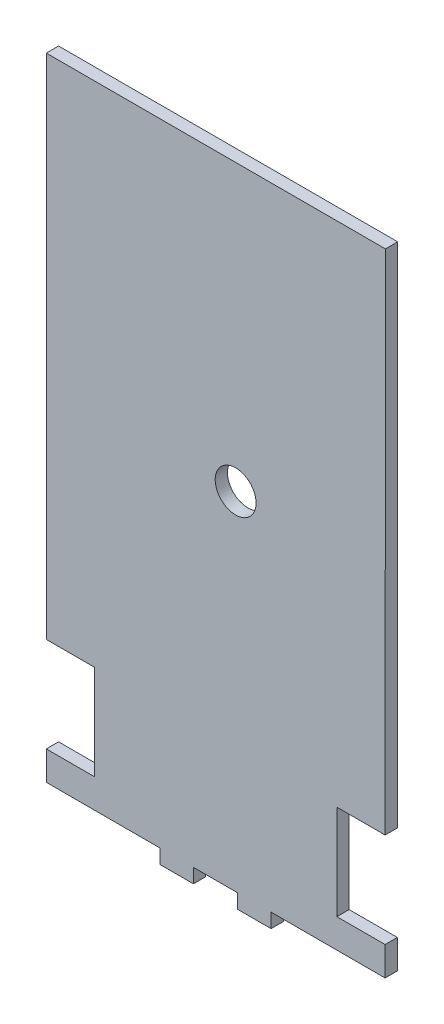
ISO-10303-21;
HEADER;
FILE_DESCRIPTION(('STEP AP214'),'2;1');
FILE_NAME('part.step','',(''),(''),'','','');
FILE_SCHEMA(('AUTOMOTIVE_DESIGN { 1 0 10303 214 1 1 1 1 }'));
ENDSEC;
DATA;
#1=APPLICATION_CONTEXT('core data for automotive mechanical design processes');
#2=APPLICATION_PROTOCOL_DEFINITION('international standard','automotive_design',2000,#1);
#3=PRODUCT_CONTEXT('',#1,'mechanical');
#4=PRODUCT('Part','Part','',(#3));
#5=PRODUCT_RELATED_PRODUCT_CATEGORY('part','',(#4));
#6=PRODUCT_DEFINITION_FORMATION('','',#4);
#7=PRODUCT_DEFINITION_CONTEXT('part definition',#1,'design');
#8=PRODUCT_DEFINITION('design','',#6,#7);
#9=PRODUCT_DEFINITION_SHAPE('','',#8);
#10=(LENGTH_UNIT() NAMED_UNIT(*) SI_UNIT(.MILLI.,.METRE.));
#11=(NAMED_UNIT(*) PLANE_ANGLE_UNIT() SI_UNIT($,.RADIAN.));
#12=(NAMED_UNIT(*) SI_UNIT($,.STERADIAN.) SOLID_ANGLE_UNIT());
#13=UNCERTAINTY_MEASURE_WITH_UNIT(LENGTH_MEASURE(1.E-05),#10,'distance_accuracy_value','');
#14=(GEOMETRIC_REPRESENTATION_CONTEXT(3) GLOBAL_UNCERTAINTY_ASSIGNED_CONTEXT((#13)) GLOBAL_UNIT_ASSIGNED_CONTEXT((#10,
#11,#12)) REPRESENTATION_CONTEXT('',''));
#15=CARTESIAN_POINT('',(0.,0.,0.));
#16=DIRECTION('',(0.,0.,1.));
#17=DIRECTION('',(1.,0.,0.));
#18=AXIS2_PLACEMENT_3D('',#15,#16,#17);
#19=CARTESIAN_POINT('',(0.,0.,3.));
#20=DIRECTION('',(0.,0.,1.));
#21=DIRECTION('',(1.,0.,0.));
#22=AXIS2_PLACEMENT_3D('',#19,#20,#21);
#23=PLANE('',#22);
#24=DIRECTION('',(-0.999999999999982,1.89197173559599E-07,0.));
#25=VECTOR('',#24,1.);
#26=CARTESIAN_POINT('',(76.7478335383416,97.6924202208451,3.));
#27=LINE('',#26,#25);
#28=CARTESIAN_POINT('',(76.7478335383416,97.6924202208451,3.));
#29=VERTEX_POINT('',#28);
#30=CARTESIAN_POINT('',(-6.25216907185528,97.692435924211,3.));
#31=VERTEX_POINT('',#30);
#32=EDGE_CURVE('E249',#29,#31,#27,.T.);
#33=ORIENTED_EDGE('',*,*,#32,.T.);
#34=DIRECTION('',(-2.21203421825731E-07,-0.999999999999976,0.));
#35=VECTOR('',#34,1.);
#36=CARTESIAN_POINT('',(-6.25216907185528,97.692435924211,3.));
#37=LINE('',#36,#35);
#38=CARTESIAN_POINT('',(-6.25219355569172,-12.9922733756148,3.));
#39=VERTEX_POINT('',#38);
#40=EDGE_CURVE('E132',#31,#39,#37,.T.);
#41=ORIENTED_EDGE('',*,*,#40,.T.);
#42=DIRECTION('',(2.77587755842413E-07,-0.999999999999961,0.));
#43=VECTOR('',#42,1.);
#44=CARTESIAN_POINT('',(-6.25219355569172,-12.9922733756148,3.));
#45=LINE('',#44,#43);
#46=CARTESIAN_POINT('',(-6.25218978671521,-26.5698769748516,3.));
#47=VERTEX_POINT('',#46);
#48=EDGE_CURVE('E303',#39,#47,#45,.T.);
#49=ORIENTED_EDGE('',*,*,#48,.T.);
#50=DIRECTION('',(1.,0.,0.));
#51=VECTOR('',#50,1.);
#52=CARTESIAN_POINT('',(-6.25218978671521,-26.5698769748516,3.));
#53=LINE('',#52,#51);
#54=CARTESIAN_POINT('',(5.54781086271086,-26.5698769748516,3.));
#55=VERTEX_POINT('',#54);
#56=EDGE_CURVE('E322',#47,#55,#53,.T.);
#57=ORIENTED_EDGE('',*,*,#56,.T.);
#58=DIRECTION('',(0.,-1.,0.));
#59=VECTOR('',#58,1.);
#60=CARTESIAN_POINT('',(5.54781086271086,-26.5698769748516,3.));
#61=LINE('',#60,#59);
#62=CARTESIAN_POINT('',(5.54781086271083,-49.7698779748516,3.));
#63=VERTEX_POINT('',#62);
#64=EDGE_CURVE('E319',#55,#63,#61,.T.);
#65=ORIENTED_EDGE('',*,*,#64,.T.);
#66=DIRECTION('',(-1.,0.,0.));
#67=VECTOR('',#66,1.);
#68=CARTESIAN_POINT('',(5.54781086271083,-49.7698779748516,3.));
#69=LINE('',#68,#67);
#70=CARTESIAN_POINT('',(-6.25219013728918,-49.7698779748515,3.));
#71=VERTEX_POINT('',#70);
#72=EDGE_CURVE('E321',#63,#71,#69,.T.);
#73=ORIENTED_EDGE('',*,*,#72,.T.);
#74=DIRECTION('',(0.,-1.,0.));
#75=VECTOR('',#74,1.);
#76=CARTESIAN_POINT('',(-6.25219013728918,-49.7698779748515,3.));
#77=LINE('',#76,#75);
#78=CARTESIAN_POINT('',(-6.25219013728918,-56.8546165615386,3.));
#79=VERTEX_POINT('',#78);
#80=EDGE_CURVE('E324',#71,#79,#77,.T.);
#81=ORIENTED_EDGE('',*,*,#80,.T.);
#82=DIRECTION('',(0.999999871937642,-0.000506087640676166,0.));
#83=VECTOR('',#82,1.);
#84=CARTESIAN_POINT('',(-6.25219013728918,-56.8546165615386,3.));
#85=LINE('',#84,#83);
#86=CARTESIAN_POINT('',(21.5551684430921,-56.8686895238382,3.));
#87=VERTEX_POINT('',#86);
#88=EDGE_CURVE('E330',#79,#87,#85,.T.);
#89=ORIENTED_EDGE('',*,*,#88,.T.);
#90=DIRECTION('',(0.,-1.,0.));
#91=VECTOR('',#90,1.);
#92=CARTESIAN_POINT('',(21.5551684430921,-56.8686895238382,3.));
#93=LINE('',#92,#91);
#94=CARTESIAN_POINT('',(21.5551684430922,-60.3622228717692,3.));
#95=VERTEX_POINT('',#94);
#96=EDGE_CURVE('E332',#87,#95,#93,.T.);
#97=ORIENTED_EDGE('',*,*,#96,.T.);
#98=DIRECTION('',(1.,0.,0.));
#99=VECTOR('',#98,1.);
#100=CARTESIAN_POINT('',(21.5551684430922,-60.3622228717692,3.));
#101=LINE('',#100,#99);
#102=CARTESIAN_POINT('',(29.7551684430922,-60.3622228717692,3.));
#103=VERTEX_POINT('',#102);
#104=EDGE_CURVE('E334',#95,#103,#101,.T.);
#105=ORIENTED_EDGE('',*,*,#104,.T.);
#106=DIRECTION('',(0.,1.,0.));
#107=VECTOR('',#106,1.);
#108=CARTESIAN_POINT('',(29.7551684430922,-60.3622228717692,3.));
#109=LINE('',#108,#107);
#110=CARTESIAN_POINT('',(29.7551684430922,-56.8622228717692,3.));
#111=VERTEX_POINT('',#110);
#112=EDGE_CURVE('E336',#103,#111,#109,.T.);
#113=ORIENTED_EDGE('',*,*,#112,.T.);
#114=DIRECTION('',(1.,0.,0.));
#115=VECTOR('',#114,1.);
#116=CARTESIAN_POINT('',(29.7551684430922,-56.8622228717692,3.));
#117=LINE('',#116,#115);
#118=CARTESIAN_POINT('',(40.5551684430922,-56.8622228717692,3.));
#119=VERTEX_POINT('',#118);
#120=EDGE_CURVE('E338',#111,#119,#117,.T.);
#121=ORIENTED_EDGE('',*,*,#120,.T.);
#122=DIRECTION('',(0.,-1.,0.));
#123=VECTOR('',#122,1.);
#124=CARTESIAN_POINT('',(40.5551684430922,-56.8622228717692,3.));
#125=LINE('',#124,#123);
#126=CARTESIAN_POINT('',(40.5551684430922,-60.3622228717692,3.));
#127=VERTEX_POINT('',#126);
#128=EDGE_CURVE('E340',#119,#127,#125,.T.);
#129=ORIENTED_EDGE('',*,*,#128,.T.);
#130=DIRECTION('',(1.,0.,0.));
#131=VECTOR('',#130,1.);
#132=CARTESIAN_POINT('',(40.5551684430922,-60.3622228717692,3.));
#133=LINE('',#132,#131);
#134=CARTESIAN_POINT('',(48.7551684430922,-60.3622228717692,3.));
#135=VERTEX_POINT('',#134);
#136=EDGE_CURVE('E342',#127,#135,#133,.T.);
#137=ORIENTED_EDGE('',*,*,#136,.T.);
#138=DIRECTION('',(0.,1.,0.));
#139=VECTOR('',#138,1.);
#140=CARTESIAN_POINT('',(48.7551684430922,-60.3622228717692,3.));
#141=LINE('',#140,#139);
#142=CARTESIAN_POINT('',(48.7551684430922,-56.8622228717692,3.));
#143=VERTEX_POINT('',#142);
#144=EDGE_CURVE('E344',#135,#143,#141,.T.);
#145=ORIENTED_EDGE('',*,*,#144,.T.);
#146=DIRECTION('',(0.999999962377515,-0.000274308163658513,0.));
#147=VECTOR('',#146,1.);
#148=CARTESIAN_POINT('',(48.7551684430922,-56.8622228717692,3.));
#149=LINE('',#148,#147);
#150=CARTESIAN_POINT('',(76.655181990109,-56.8698760735393,3.));
#151=VERTEX_POINT('',#150);
#152=EDGE_CURVE('E346',#143,#151,#149,.T.);
#153=ORIENTED_EDGE('',*,*,#152,.T.);
#154=DIRECTION('',(0.,1.,0.));
#155=VECTOR('',#154,1.);
#156=CARTESIAN_POINT('',(76.655181990109,-56.8698760735393,3.));
#157=LINE('',#156,#155);
#158=CARTESIAN_POINT('',(76.655181990109,-49.7698780735393,3.));
#159=VERTEX_POINT('',#158);
#160=EDGE_CURVE('E348',#151,#159,#157,.T.);
#161=ORIENTED_EDGE('',*,*,#160,.T.);
#162=DIRECTION('',(-1.,0.,0.));
#163=VECTOR('',#162,1.);
#164=CARTESIAN_POINT('',(76.655181990109,-49.7698780735393,3.));
#165=LINE('',#164,#163);
#166=CARTESIAN_POINT('',(64.8551819901089,-49.7698780735393,3.));
#167=VERTEX_POINT('',#166);
#168=EDGE_CURVE('E190',#159,#167,#165,.T.);
#169=ORIENTED_EDGE('',*,*,#168,.T.);
#170=DIRECTION('',(0.,1.,0.));
#171=VECTOR('',#170,1.);
#172=CARTESIAN_POINT('',(64.8551819901089,-49.7698780735393,3.));
#173=LINE('',#172,#171);
#174=CARTESIAN_POINT('',(64.855181990109,-26.5698770735393,3.));
#175=VERTEX_POINT('',#174);
#176=EDGE_CURVE('E184',#167,#175,#173,.T.);
#177=ORIENTED_EDGE('',*,*,#176,.T.);
#178=DIRECTION('',(1.,0.,0.));
#179=VECTOR('',#178,1.);
#180=CARTESIAN_POINT('',(64.855181990109,-26.5698770735393,3.));
#181=LINE('',#180,#179);
#182=CARTESIAN_POINT('',(76.655181990109,-26.5698770735393,3.));
#183=VERTEX_POINT('',#182);
#184=EDGE_CURVE('E188',#175,#183,#181,.T.);
#185=ORIENTED_EDGE('',*,*,#184,.T.);
#186=DIRECTION('',(0.000745612502711411,0.999999722030959,0.));
#187=VECTOR('',#186,1.);
#188=CARTESIAN_POINT('',(76.655181990109,-26.5698770735393,3.));
#189=LINE('',#188,#187);
#190=EDGE_CURVE('E50',#183,#29,#189,.T.);
#191=ORIENTED_EDGE('',*,*,#190,.T.);
#192=EDGE_LOOP('',(#33,#41,#49,#57,#65,#73,#81,#89,#97,#105,#113,#121,#129,#137,#145,#153,#161,
#169,#177,#185,#191));
#193=FACE_BOUND('',#192,.T.);
#194=CARTESIAN_POINT('',(40.0855570461366,27.9705597540581,3.));
#195=DIRECTION('',(0.,0.,1.));
#196=DIRECTION('',(1.,0.,0.));
#197=AXIS2_PLACEMENT_3D('',#194,#195,#196);
#198=CIRCLE('',#197,5.);
#199=CARTESIAN_POINT('',(45.0855570461366,27.9705597540581,3.));
#200=VERTEX_POINT('',#199);
#201=EDGE_CURVE('E212',#200,#200,#198,.T.);
#202=ORIENTED_EDGE('',*,*,#201,.F.);
#203=EDGE_LOOP('',(#202));
#204=FACE_BOUND('',#203,.T.);
#205=ADVANCED_FACE('F33',(#193,#204),#23,.T.);
#206=CARTESIAN_POINT('',(0.,0.,0.));
#207=DIRECTION('',(0.,0.,1.));
#208=DIRECTION('',(1.,0.,0.));
#209=AXIS2_PLACEMENT_3D('',#206,#207,#208);
#210=PLANE('',#209);
#211=DIRECTION('',(-0.999999999999982,1.89197173559599E-07,0.));
#212=VECTOR('',#211,1.);
#213=CARTESIAN_POINT('',(76.7478335383416,97.6924202208451,0.));
#214=LINE('',#213,#212);
#215=CARTESIAN_POINT('',(76.7478335383416,97.6924202208451,0.));
#216=VERTEX_POINT('',#215);
#217=CARTESIAN_POINT('',(-6.25216907185528,97.692435924211,0.));
#218=VERTEX_POINT('',#217);
#219=EDGE_CURVE('E208',#216,#218,#214,.T.);
#220=ORIENTED_EDGE('',*,*,#219,.F.);
#221=DIRECTION('',(0.000745612502711411,0.999999722030959,0.));
#222=VECTOR('',#221,1.);
#223=CARTESIAN_POINT('',(76.655181990109,-26.5698770735393,0.));
#224=LINE('',#223,#222);
#225=CARTESIAN_POINT('',(76.655181990109,-26.5698770735393,0.));
#226=VERTEX_POINT('',#225);
#227=EDGE_CURVE('E124',#226,#216,#224,.T.);
#228=ORIENTED_EDGE('',*,*,#227,.F.);
#229=DIRECTION('',(1.,0.,0.));
#230=VECTOR('',#229,1.);
#231=CARTESIAN_POINT('',(64.855181990109,-26.5698770735393,0.));
#232=LINE('',#231,#230);
#233=CARTESIAN_POINT('',(64.855181990109,-26.5698770735393,0.));
#234=VERTEX_POINT('',#233);
#235=EDGE_CURVE('E118',#234,#226,#232,.T.);
#236=ORIENTED_EDGE('',*,*,#235,.F.);
#237=DIRECTION('',(0.,1.,0.));
#238=VECTOR('',#237,1.);
#239=CARTESIAN_POINT('',(64.8551819901089,-49.7698780735393,0.));
#240=LINE('',#239,#238);
#241=CARTESIAN_POINT('',(64.8551819901089,-49.7698780735393,0.));
#242=VERTEX_POINT('',#241);
#243=EDGE_CURVE('E198',#242,#234,#240,.T.);
#244=ORIENTED_EDGE('',*,*,#243,.F.);
#245=DIRECTION('',(-1.,0.,0.));
#246=VECTOR('',#245,1.);
#247=CARTESIAN_POINT('',(76.655181990109,-49.7698780735393,0.));
#248=LINE('',#247,#246);
#249=CARTESIAN_POINT('',(76.655181990109,-49.7698780735393,0.));
#250=VERTEX_POINT('',#249);
#251=EDGE_CURVE('E244',#250,#242,#248,.T.);
#252=ORIENTED_EDGE('',*,*,#251,.F.);
#253=DIRECTION('',(0.,1.,0.));
#254=VECTOR('',#253,1.);
#255=CARTESIAN_POINT('',(76.655181990109,-56.8698760735393,0.));
#256=LINE('',#255,#254);
#257=CARTESIAN_POINT('',(76.655181990109,-56.8698760735393,0.));
#258=VERTEX_POINT('',#257);
#259=EDGE_CURVE('E242',#258,#250,#256,.T.);
#260=ORIENTED_EDGE('',*,*,#259,.F.);
#261=DIRECTION('',(0.999999962377515,-0.000274308163658513,0.));
#262=VECTOR('',#261,1.);
#263=CARTESIAN_POINT('',(48.7551684430922,-56.8622228717692,0.));
#264=LINE('',#263,#262);
#265=CARTESIAN_POINT('',(48.7551684430922,-56.8622228717692,0.));
#266=VERTEX_POINT('',#265);
#267=EDGE_CURVE('E240',#266,#258,#264,.T.);
#268=ORIENTED_EDGE('',*,*,#267,.F.);
#269=DIRECTION('',(0.,1.,0.));
#270=VECTOR('',#269,1.);
#271=CARTESIAN_POINT('',(48.7551684430922,-60.3622228717692,0.));
#272=LINE('',#271,#270);
#273=CARTESIAN_POINT('',(48.7551684430922,-60.3622228717692,0.));
#274=VERTEX_POINT('',#273);
#275=EDGE_CURVE('E238',#274,#266,#272,.T.);
#276=ORIENTED_EDGE('',*,*,#275,.F.);
#277=DIRECTION('',(1.,0.,0.));
#278=VECTOR('',#277,1.);
#279=CARTESIAN_POINT('',(40.5551684430922,-60.3622228717692,0.));
#280=LINE('',#279,#278);
#281=CARTESIAN_POINT('',(40.5551684430922,-60.3622228717692,0.));
#282=VERTEX_POINT('',#281);
#283=EDGE_CURVE('E236',#282,#274,#280,.T.);
#284=ORIENTED_EDGE('',*,*,#283,.F.);
#285=DIRECTION('',(0.,-1.,0.));
#286=VECTOR('',#285,1.);
#287=CARTESIAN_POINT('',(40.5551684430922,-56.8622228717692,0.));
#288=LINE('',#287,#286);
#289=CARTESIAN_POINT('',(40.5551684430922,-56.8622228717692,0.));
#290=VERTEX_POINT('',#289);
#291=EDGE_CURVE('E234',#290,#282,#288,.T.);
#292=ORIENTED_EDGE('',*,*,#291,.F.);
#293=DIRECTION('',(1.,0.,0.));
#294=VECTOR('',#293,1.);
#295=CARTESIAN_POINT('',(29.7551684430922,-56.8622228717692,0.));
#296=LINE('',#295,#294);
#297=CARTESIAN_POINT('',(29.7551684430922,-56.8622228717692,0.));
#298=VERTEX_POINT('',#297);
#299=EDGE_CURVE('E232',#298,#290,#296,.T.);
#300=ORIENTED_EDGE('',*,*,#299,.F.);
#301=DIRECTION('',(0.,1.,0.));
#302=VECTOR('',#301,1.);
#303=CARTESIAN_POINT('',(29.7551684430922,-60.3622228717692,0.));
#304=LINE('',#303,#302);
#305=CARTESIAN_POINT('',(29.7551684430922,-60.3622228717692,0.));
#306=VERTEX_POINT('',#305);
#307=EDGE_CURVE('E230',#306,#298,#304,.T.);
#308=ORIENTED_EDGE('',*,*,#307,.F.);
#309=DIRECTION('',(1.,0.,0.));
#310=VECTOR('',#309,1.);
#311=CARTESIAN_POINT('',(21.5551684430922,-60.3622228717692,0.));
#312=LINE('',#311,#310);
#313=CARTESIAN_POINT('',(21.5551684430922,-60.3622228717692,0.));
#314=VERTEX_POINT('',#313);
#315=EDGE_CURVE('E228',#314,#306,#312,.T.);
#316=ORIENTED_EDGE('',*,*,#315,.F.);
#317=DIRECTION('',(0.,-1.,0.));
#318=VECTOR('',#317,1.);
#319=CARTESIAN_POINT('',(21.5551684430921,-56.8686895238382,0.));
#320=LINE('',#319,#318);
#321=CARTESIAN_POINT('',(21.5551684430921,-56.8686895238382,0.));
#322=VERTEX_POINT('',#321);
#323=EDGE_CURVE('E226',#322,#314,#320,.T.);
#324=ORIENTED_EDGE('',*,*,#323,.F.);
#325=DIRECTION('',(0.999999871937642,-0.000506087640676166,0.));
#326=VECTOR('',#325,1.);
#327=CARTESIAN_POINT('',(-6.25219013728918,-56.8546165615386,0.));
#328=LINE('',#327,#326);
#329=CARTESIAN_POINT('',(-6.25219013728918,-56.8546165615386,0.));
#330=VERTEX_POINT('',#329);
#331=EDGE_CURVE('E224',#330,#322,#328,.T.);
#332=ORIENTED_EDGE('',*,*,#331,.F.);
#333=DIRECTION('',(0.,-1.,0.));
#334=VECTOR('',#333,1.);
#335=CARTESIAN_POINT('',(-6.25219013728918,-49.7698779748515,0.));
#336=LINE('',#335,#334);
#337=CARTESIAN_POINT('',(-6.25219013728918,-49.7698779748515,0.));
#338=VERTEX_POINT('',#337);
#339=EDGE_CURVE('E222',#338,#330,#336,.T.);
#340=ORIENTED_EDGE('',*,*,#339,.F.);
#341=DIRECTION('',(-1.,0.,0.));
#342=VECTOR('',#341,1.);
#343=CARTESIAN_POINT('',(5.54781086271083,-49.7698779748516,0.));
#344=LINE('',#343,#342);
#345=CARTESIAN_POINT('',(5.54781086271083,-49.7698779748516,0.));
#346=VERTEX_POINT('',#345);
#347=EDGE_CURVE('E220',#346,#338,#344,.T.);
#348=ORIENTED_EDGE('',*,*,#347,.F.);
#349=DIRECTION('',(0.,-1.,0.));
#350=VECTOR('',#349,1.);
#351=CARTESIAN_POINT('',(5.54781086271086,-26.5698769748516,0.));
#352=LINE('',#351,#350);
#353=CARTESIAN_POINT('',(5.54781086271086,-26.5698769748516,0.));
#354=VERTEX_POINT('',#353);
#355=EDGE_CURVE('E218',#354,#346,#352,.T.);
#356=ORIENTED_EDGE('',*,*,#355,.F.);
#357=DIRECTION('',(1.,0.,0.));
#358=VECTOR('',#357,1.);
#359=CARTESIAN_POINT('',(-6.25218978671521,-26.5698769748516,0.));
#360=LINE('',#359,#358);
#361=CARTESIAN_POINT('',(-6.25218978671521,-26.5698769748516,0.));
#362=VERTEX_POINT('',#361);
#363=EDGE_CURVE('E216',#362,#354,#360,.T.);
#364=ORIENTED_EDGE('',*,*,#363,.F.);
#365=DIRECTION('',(2.77587755842413E-07,-0.999999999999961,0.));
#366=VECTOR('',#365,1.);
#367=CARTESIAN_POINT('',(-6.25219355569172,-12.9922733756148,0.));
#368=LINE('',#367,#366);
#369=CARTESIAN_POINT('',(-6.25219355569172,-12.9922733756148,0.));
#370=VERTEX_POINT('',#369);
#371=EDGE_CURVE('E214',#370,#362,#368,.T.);
#372=ORIENTED_EDGE('',*,*,#371,.F.);
#373=DIRECTION('',(-2.21203421825731E-07,-0.999999999999976,0.));
#374=VECTOR('',#373,1.);
#375=CARTESIAN_POINT('',(-6.25216907185528,97.692435924211,0.));
#376=LINE('',#375,#374);
#377=EDGE_CURVE('E211',#218,#370,#376,.T.);
#378=ORIENTED_EDGE('',*,*,#377,.F.);
#379=EDGE_LOOP('',(#220,#228,#236,#244,#252,#260,#268,#276,#284,#292,#300,#308,#316,#324,#332,
#340,#348,#356,#364,#372,#378));
#380=FACE_BOUND('',#379,.T.);
#381=CARTESIAN_POINT('',(40.0855570461366,27.9705597540581,0.));
#382=DIRECTION('',(0.,0.,1.));
#383=DIRECTION('',(1.,0.,0.));
#384=AXIS2_PLACEMENT_3D('',#381,#382,#383);
#385=CIRCLE('',#384,5.);
#386=CARTESIAN_POINT('',(45.0855570461366,27.9705597540581,0.));
#387=VERTEX_POINT('',#386);
#388=EDGE_CURVE('E612',#387,#387,#385,.T.);
#389=ORIENTED_EDGE('',*,*,#388,.T.);
#390=EDGE_LOOP('',(#389));
#391=FACE_BOUND('',#390,.T.);
#392=ADVANCED_FACE('F307',(#380,#391),#210,.F.);
#393=CARTESIAN_POINT('',(76.7478335383416,97.6924202208451,3.));
#394=DIRECTION('',(-1.89197173559599E-07,-0.999999999999982,0.));
#395=DIRECTION('',(0.999999999999982,-1.89197173559599E-07,0.));
#396=AXIS2_PLACEMENT_3D('',#393,#394,#395);
#397=PLANE('',#396);
#398=ORIENTED_EDGE('',*,*,#219,.T.);
#399=DIRECTION('',(0.,0.,-1.));
#400=VECTOR('',#399,1.);
#401=CARTESIAN_POINT('',(-6.25216907185528,97.692435924211,3.));
#402=LINE('',#401,#400);
#403=EDGE_CURVE('E11',#31,#218,#402,.T.);
#404=ORIENTED_EDGE('',*,*,#403,.F.);
#405=ORIENTED_EDGE('',*,*,#32,.F.);
#406=DIRECTION('',(0.,0.,-1.));
#407=VECTOR('',#406,1.);
#408=CARTESIAN_POINT('',(76.7478335383416,97.6924202208451,3.));
#409=LINE('',#408,#407);
#410=EDGE_CURVE('E204',#29,#216,#409,.T.);
#411=ORIENTED_EDGE('',*,*,#410,.T.);
#412=EDGE_LOOP('',(#398,#404,#405,#411));
#413=FACE_BOUND('',#412,.T.);
#414=ADVANCED_FACE('F35',(#413),#397,.F.);
#415=CARTESIAN_POINT('',(-6.25216907185528,97.692435924211,3.));
#416=DIRECTION('',(0.999999999999975,-2.21203421825731E-07,0.));
#417=DIRECTION('',(2.21203421825731E-07,0.999999999999976,0.));
#418=AXIS2_PLACEMENT_3D('',#415,#416,#417);
#419=PLANE('',#418);
#420=ORIENTED_EDGE('',*,*,#377,.T.);
#421=DIRECTION('',(0.,0.,-1.));
#422=VECTOR('',#421,1.);
#423=CARTESIAN_POINT('',(-6.25219355569172,-12.9922733756148,3.));
#424=LINE('',#423,#422);
#425=EDGE_CURVE('E42',#39,#370,#424,.T.);
#426=ORIENTED_EDGE('',*,*,#425,.F.);
#427=ORIENTED_EDGE('',*,*,#40,.F.);
#428=ORIENTED_EDGE('',*,*,#403,.T.);
#429=EDGE_LOOP('',(#420,#426,#427,#428));
#430=FACE_BOUND('',#429,.T.);
#431=ADVANCED_FACE('F382',(#430),#419,.F.);
#432=CARTESIAN_POINT('',(-6.25219355569172,-12.9922733756148,3.));
#433=DIRECTION('',(0.999999999999962,2.77587755842413E-07,0.));
#434=DIRECTION('',(-2.77587755842413E-07,0.999999999999962,0.));
#435=AXIS2_PLACEMENT_3D('',#432,#433,#434);
#436=PLANE('',#435);
#437=ORIENTED_EDGE('',*,*,#371,.T.);
#438=DIRECTION('',(0.,0.,-1.));
#439=VECTOR('',#438,1.);
#440=CARTESIAN_POINT('',(-6.25218978671521,-26.5698769748516,3.));
#441=LINE('',#440,#439);
#442=EDGE_CURVE('E295',#47,#362,#441,.T.);
#443=ORIENTED_EDGE('',*,*,#442,.F.);
#444=ORIENTED_EDGE('',*,*,#48,.F.);
#445=ORIENTED_EDGE('',*,*,#425,.T.);
#446=EDGE_LOOP('',(#437,#443,#444,#445));
#447=FACE_BOUND('',#446,.T.);
#448=ADVANCED_FACE('F301',(#447),#436,.F.);
#449=CARTESIAN_POINT('',(-6.25218978671521,-26.5698769748516,3.));
#450=DIRECTION('',(0.,1.,0.));
#451=DIRECTION('',(-1.,0.,0.));
#452=AXIS2_PLACEMENT_3D('',#449,#450,#451);
#453=PLANE('',#452);
#454=ORIENTED_EDGE('',*,*,#363,.T.);
#455=DIRECTION('',(0.,0.,-1.));
#456=VECTOR('',#455,1.);
#457=CARTESIAN_POINT('',(5.54781086271086,-26.5698769748516,3.));
#458=LINE('',#457,#456);
#459=EDGE_CURVE('E292',#55,#354,#458,.T.);
#460=ORIENTED_EDGE('',*,*,#459,.F.);
#461=ORIENTED_EDGE('',*,*,#56,.F.);
#462=ORIENTED_EDGE('',*,*,#442,.T.);
#463=EDGE_LOOP('',(#454,#460,#461,#462));
#464=FACE_BOUND('',#463,.T.);
#465=ADVANCED_FACE('F313',(#464),#453,.F.);
#466=CARTESIAN_POINT('',(5.54781086271086,-26.5698769748516,3.));
#467=DIRECTION('',(1.,0.,0.));
#468=DIRECTION('',(0.,1.,0.));
#469=AXIS2_PLACEMENT_3D('',#466,#467,#468);
#470=PLANE('',#469);
#471=ORIENTED_EDGE('',*,*,#355,.T.);
#472=DIRECTION('',(0.,0.,-1.));
#473=VECTOR('',#472,1.);
#474=CARTESIAN_POINT('',(5.54781086271083,-49.7698779748516,3.));
#475=LINE('',#474,#473);
#476=EDGE_CURVE('E289',#63,#346,#475,.T.);
#477=ORIENTED_EDGE('',*,*,#476,.F.);
#478=ORIENTED_EDGE('',*,*,#64,.F.);
#479=ORIENTED_EDGE('',*,*,#459,.T.);
#480=EDGE_LOOP('',(#471,#477,#478,#479));
#481=FACE_BOUND('',#480,.T.);
#482=ADVANCED_FACE('F317',(#481),#470,.F.);
#483=CARTESIAN_POINT('',(5.54781086271083,-49.7698779748516,3.));
#484=DIRECTION('',(0.,-1.,0.));
#485=DIRECTION('',(1.,0.,0.));
#486=AXIS2_PLACEMENT_3D('',#483,#484,#485);
#487=PLANE('',#486);
#488=ORIENTED_EDGE('',*,*,#347,.T.);
#489=DIRECTION('',(0.,0.,-1.));
#490=VECTOR('',#489,1.);
#491=CARTESIAN_POINT('',(-6.25219013728918,-49.7698779748515,3.));
#492=LINE('',#491,#490);
#493=EDGE_CURVE('E286',#71,#338,#492,.T.);
#494=ORIENTED_EDGE('',*,*,#493,.F.);
#495=ORIENTED_EDGE('',*,*,#72,.F.);
#496=ORIENTED_EDGE('',*,*,#476,.T.);
#497=EDGE_LOOP('',(#488,#494,#495,#496));
#498=FACE_BOUND('',#497,.T.);
#499=ADVANCED_FACE('F395',(#498),#487,.F.);
#500=CARTESIAN_POINT('',(-6.25219013728918,-49.7698779748515,3.));
#501=DIRECTION('',(1.,0.,0.));
#502=DIRECTION('',(0.,0.,-1.));
#503=AXIS2_PLACEMENT_3D('',#500,#501,#502);
#504=PLANE('',#503);
#505=ORIENTED_EDGE('',*,*,#339,.T.);
#506=DIRECTION('',(0.,0.,-1.));
#507=VECTOR('',#506,1.);
#508=CARTESIAN_POINT('',(-6.25219013728918,-56.8546165615386,3.));
#509=LINE('',#508,#507);
#510=EDGE_CURVE('E283',#79,#330,#509,.T.);
#511=ORIENTED_EDGE('',*,*,#510,.F.);
#512=ORIENTED_EDGE('',*,*,#80,.F.);
#513=ORIENTED_EDGE('',*,*,#493,.T.);
#514=EDGE_LOOP('',(#505,#511,#512,#513));
#515=FACE_BOUND('',#514,.T.);
#516=ADVANCED_FACE('F398',(#515),#504,.F.);
#517=CARTESIAN_POINT('',(-6.25219013728918,-56.8546165615386,3.));
#518=DIRECTION('',(0.000506087640676166,0.999999871937642,0.));
#519=DIRECTION('',(-0.999999871937642,0.000506087640676166,0.));
#520=AXIS2_PLACEMENT_3D('',#517,#518,#519);
#521=PLANE('',#520);
#522=ORIENTED_EDGE('',*,*,#331,.T.);
#523=DIRECTION('',(0.,0.,-1.));
#524=VECTOR('',#523,1.);
#525=CARTESIAN_POINT('',(21.5551684430921,-56.8686895238382,3.));
#526=LINE('',#525,#524);
#527=EDGE_CURVE('E280',#87,#322,#526,.T.);
#528=ORIENTED_EDGE('',*,*,#527,.F.);
#529=ORIENTED_EDGE('',*,*,#88,.F.);
#530=ORIENTED_EDGE('',*,*,#510,.T.);
#531=EDGE_LOOP('',(#522,#528,#529,#530));
#532=FACE_BOUND('',#531,.T.);
#533=ADVANCED_FACE('F402',(#532),#521,.F.);
#534=CARTESIAN_POINT('',(21.5551684430921,-56.8686895238382,3.));
#535=DIRECTION('',(1.,0.,0.));
#536=DIRECTION('',(0.,1.,0.));
#537=AXIS2_PLACEMENT_3D('',#534,#535,#536);
#538=PLANE('',#537);
#539=ORIENTED_EDGE('',*,*,#323,.T.);
#540=DIRECTION('',(0.,0.,-1.));
#541=VECTOR('',#540,1.);
#542=CARTESIAN_POINT('',(21.5551684430922,-60.3622228717692,3.));
#543=LINE('',#542,#541);
#544=EDGE_CURVE('E277',#95,#314,#543,.T.);
#545=ORIENTED_EDGE('',*,*,#544,.F.);
#546=ORIENTED_EDGE('',*,*,#96,.F.);
#547=ORIENTED_EDGE('',*,*,#527,.T.);
#548=EDGE_LOOP('',(#539,#545,#546,#547));
#549=FACE_BOUND('',#548,.T.);
#550=ADVANCED_FACE('F406',(#549),#538,.F.);
#551=CARTESIAN_POINT('',(21.5551684430922,-60.3622228717692,3.));
#552=DIRECTION('',(0.,1.,0.));
#553=DIRECTION('',(0.,0.,1.));
#554=AXIS2_PLACEMENT_3D('',#551,#552,#553);
#555=PLANE('',#554);
#556=ORIENTED_EDGE('',*,*,#315,.T.);
#557=DIRECTION('',(0.,0.,-1.));
#558=VECTOR('',#557,1.);
#559=CARTESIAN_POINT('',(29.7551684430922,-60.3622228717692,3.));
#560=LINE('',#559,#558);
#561=EDGE_CURVE('E274',#103,#306,#560,.T.);
#562=ORIENTED_EDGE('',*,*,#561,.F.);
#563=ORIENTED_EDGE('',*,*,#104,.F.);
#564=ORIENTED_EDGE('',*,*,#544,.T.);
#565=EDGE_LOOP('',(#556,#562,#563,#564));
#566=FACE_BOUND('',#565,.T.);
#567=ADVANCED_FACE('F410',(#566),#555,.F.);
#568=CARTESIAN_POINT('',(29.7551684430922,-60.3622228717692,3.));
#569=DIRECTION('',(-1.,0.,0.));
#570=DIRECTION('',(0.,0.,1.));
#571=AXIS2_PLACEMENT_3D('',#568,#569,#570);
#572=PLANE('',#571);
#573=ORIENTED_EDGE('',*,*,#307,.T.);
#574=DIRECTION('',(0.,0.,-1.));
#575=VECTOR('',#574,1.);
#576=CARTESIAN_POINT('',(29.7551684430922,-56.8622228717692,3.));
#577=LINE('',#576,#575);
#578=EDGE_CURVE('E271',#111,#298,#577,.T.);
#579=ORIENTED_EDGE('',*,*,#578,.F.);
#580=ORIENTED_EDGE('',*,*,#112,.F.);
#581=ORIENTED_EDGE('',*,*,#561,.T.);
#582=EDGE_LOOP('',(#573,#579,#580,#581));
#583=FACE_BOUND('',#582,.T.);
#584=ADVANCED_FACE('F414',(#583),#572,.F.);
#585=CARTESIAN_POINT('',(29.7551684430922,-56.8622228717692,3.));
#586=DIRECTION('',(0.,1.,0.));
#587=DIRECTION('',(0.,0.,1.));
#588=AXIS2_PLACEMENT_3D('',#585,#586,#587);
#589=PLANE('',#588);
#590=ORIENTED_EDGE('',*,*,#299,.T.);
#591=DIRECTION('',(0.,0.,-1.));
#592=VECTOR('',#591,1.);
#593=CARTESIAN_POINT('',(40.5551684430922,-56.8622228717692,3.));
#594=LINE('',#593,#592);
#595=EDGE_CURVE('E268',#119,#290,#594,.T.);
#596=ORIENTED_EDGE('',*,*,#595,.F.);
#597=ORIENTED_EDGE('',*,*,#120,.F.);
#598=ORIENTED_EDGE('',*,*,#578,.T.);
#599=EDGE_LOOP('',(#590,#596,#597,#598));
#600=FACE_BOUND('',#599,.T.);
#601=ADVANCED_FACE('F418',(#600),#589,.F.);
#602=CARTESIAN_POINT('',(40.5551684430922,-56.8622228717692,3.));
#603=DIRECTION('',(1.,0.,0.));
#604=DIRECTION('',(0.,0.,-1.));
#605=AXIS2_PLACEMENT_3D('',#602,#603,#604);
#606=PLANE('',#605);
#607=ORIENTED_EDGE('',*,*,#291,.T.);
#608=DIRECTION('',(0.,0.,-1.));
#609=VECTOR('',#608,1.);
#610=CARTESIAN_POINT('',(40.5551684430922,-60.3622228717692,3.));
#611=LINE('',#610,#609);
#612=EDGE_CURVE('E265',#127,#282,#611,.T.);
#613=ORIENTED_EDGE('',*,*,#612,.F.);
#614=ORIENTED_EDGE('',*,*,#128,.F.);
#615=ORIENTED_EDGE('',*,*,#595,.T.);
#616=EDGE_LOOP('',(#607,#613,#614,#615));
#617=FACE_BOUND('',#616,.T.);
#618=ADVANCED_FACE('F422',(#617),#606,.F.);
#619=CARTESIAN_POINT('',(40.5551684430922,-60.3622228717692,3.));
#620=DIRECTION('',(0.,1.,0.));
#621=DIRECTION('',(-1.,0.,0.));
#622=AXIS2_PLACEMENT_3D('',#619,#620,#621);
#623=PLANE('',#622);
#624=ORIENTED_EDGE('',*,*,#283,.T.);
#625=DIRECTION('',(0.,0.,-1.));
#626=VECTOR('',#625,1.);
#627=CARTESIAN_POINT('',(48.7551684430922,-60.3622228717692,3.));
#628=LINE('',#627,#626);
#629=EDGE_CURVE('E262',#135,#274,#628,.T.);
#630=ORIENTED_EDGE('',*,*,#629,.F.);
#631=ORIENTED_EDGE('',*,*,#136,.F.);
#632=ORIENTED_EDGE('',*,*,#612,.T.);
#633=EDGE_LOOP('',(#624,#630,#631,#632));
#634=FACE_BOUND('',#633,.T.);
#635=ADVANCED_FACE('F426',(#634),#623,.F.);
#636=CARTESIAN_POINT('',(48.7551684430922,-60.3622228717692,3.));
#637=DIRECTION('',(-1.,0.,0.));
#638=DIRECTION('',(0.,0.,1.));
#639=AXIS2_PLACEMENT_3D('',#636,#637,#638);
#640=PLANE('',#639);
#641=ORIENTED_EDGE('',*,*,#275,.T.);
#642=DIRECTION('',(0.,0.,-1.));
#643=VECTOR('',#642,1.);
#644=CARTESIAN_POINT('',(48.7551684430922,-56.8622228717692,3.));
#645=LINE('',#644,#643);
#646=EDGE_CURVE('E259',#143,#266,#645,.T.);
#647=ORIENTED_EDGE('',*,*,#646,.F.);
#648=ORIENTED_EDGE('',*,*,#144,.F.);
#649=ORIENTED_EDGE('',*,*,#629,.T.);
#650=EDGE_LOOP('',(#641,#647,#648,#649));
#651=FACE_BOUND('',#650,.T.);
#652=ADVANCED_FACE('F430',(#651),#640,.F.);
#653=CARTESIAN_POINT('',(48.7551684430922,-56.8622228717692,3.));
#654=DIRECTION('',(0.000274308163658513,0.999999962377515,0.));
#655=DIRECTION('',(-0.999999962377515,0.000274308163658513,0.));
#656=AXIS2_PLACEMENT_3D('',#653,#654,#655);
#657=PLANE('',#656);
#658=ORIENTED_EDGE('',*,*,#267,.T.);
#659=DIRECTION('',(0.,0.,-1.));
#660=VECTOR('',#659,1.);
#661=CARTESIAN_POINT('',(76.655181990109,-56.8698760735393,3.));
#662=LINE('',#661,#660);
#663=EDGE_CURVE('E256',#151,#258,#662,.T.);
#664=ORIENTED_EDGE('',*,*,#663,.F.);
#665=ORIENTED_EDGE('',*,*,#152,.F.);
#666=ORIENTED_EDGE('',*,*,#646,.T.);
#667=EDGE_LOOP('',(#658,#664,#665,#666));
#668=FACE_BOUND('',#667,.T.);
#669=ADVANCED_FACE('F434',(#668),#657,.F.);
#670=CARTESIAN_POINT('',(76.655181990109,-56.8698760735393,3.));
#671=DIRECTION('',(-1.,0.,0.));
#672=DIRECTION('',(0.,0.,1.));
#673=AXIS2_PLACEMENT_3D('',#670,#671,#672);
#674=PLANE('',#673);
#675=ORIENTED_EDGE('',*,*,#259,.T.);
#676=DIRECTION('',(0.,0.,-1.));
#677=VECTOR('',#676,1.);
#678=CARTESIAN_POINT('',(76.655181990109,-49.7698780735393,3.));
#679=LINE('',#678,#677);
#680=EDGE_CURVE('E253',#159,#250,#679,.T.);
#681=ORIENTED_EDGE('',*,*,#680,.F.);
#682=ORIENTED_EDGE('',*,*,#160,.F.);
#683=ORIENTED_EDGE('',*,*,#663,.T.);
#684=EDGE_LOOP('',(#675,#681,#682,#683));
#685=FACE_BOUND('',#684,.T.);
#686=ADVANCED_FACE('F354',(#685),#674,.F.);
#687=CARTESIAN_POINT('',(76.655181990109,-49.7698780735393,3.));
#688=DIRECTION('',(0.,-1.,0.));
#689=DIRECTION('',(0.,0.,-1.));
#690=AXIS2_PLACEMENT_3D('',#687,#688,#689);
#691=PLANE('',#690);
#692=ORIENTED_EDGE('',*,*,#251,.T.);
#693=DIRECTION('',(0.,0.,-1.));
#694=VECTOR('',#693,1.);
#695=CARTESIAN_POINT('',(64.8551819901089,-49.7698780735393,3.));
#696=LINE('',#695,#694);
#697=EDGE_CURVE('E199',#167,#242,#696,.T.);
#698=ORIENTED_EDGE('',*,*,#697,.F.);
#699=ORIENTED_EDGE('',*,*,#168,.F.);
#700=ORIENTED_EDGE('',*,*,#680,.T.);
#701=EDGE_LOOP('',(#692,#698,#699,#700));
#702=FACE_BOUND('',#701,.T.);
#703=ADVANCED_FACE('F358',(#702),#691,.F.);
#704=CARTESIAN_POINT('',(64.8551819901089,-49.7698780735393,3.));
#705=DIRECTION('',(-1.,0.,0.));
#706=DIRECTION('',(0.,-1.,0.));
#707=AXIS2_PLACEMENT_3D('',#704,#705,#706);
#708=PLANE('',#707);
#709=ORIENTED_EDGE('',*,*,#243,.T.);
#710=DIRECTION('',(0.,0.,-1.));
#711=VECTOR('',#710,1.);
#712=CARTESIAN_POINT('',(64.855181990109,-26.5698770735393,3.));
#713=LINE('',#712,#711);
#714=EDGE_CURVE('E195',#175,#234,#713,.T.);
#715=ORIENTED_EDGE('',*,*,#714,.F.);
#716=ORIENTED_EDGE('',*,*,#176,.F.);
#717=ORIENTED_EDGE('',*,*,#697,.T.);
#718=EDGE_LOOP('',(#709,#715,#716,#717));
#719=FACE_BOUND('',#718,.T.);
#720=ADVANCED_FACE('F196',(#719),#708,.F.);
#721=CARTESIAN_POINT('',(64.855181990109,-26.5698770735393,3.));
#722=DIRECTION('',(0.,1.,0.));
#723=DIRECTION('',(0.,0.,1.));
#724=AXIS2_PLACEMENT_3D('',#721,#722,#723);
#725=PLANE('',#724);
#726=ORIENTED_EDGE('',*,*,#235,.T.);
#727=DIRECTION('',(0.,0.,-1.));
#728=VECTOR('',#727,1.);
#729=CARTESIAN_POINT('',(76.655181990109,-26.5698770735393,3.));
#730=LINE('',#729,#728);
#731=EDGE_CURVE('E200',#183,#226,#730,.T.);
#732=ORIENTED_EDGE('',*,*,#731,.F.);
#733=ORIENTED_EDGE('',*,*,#184,.F.);
#734=ORIENTED_EDGE('',*,*,#714,.T.);
#735=EDGE_LOOP('',(#726,#732,#733,#734));
#736=FACE_BOUND('',#735,.T.);
#737=ADVANCED_FACE('F202',(#736),#725,.F.);
#738=CARTESIAN_POINT('',(76.655181990109,-26.5698770735393,3.));
#739=DIRECTION('',(-0.999999722030959,0.000745612502711411,0.));
#740=DIRECTION('',(-0.000745612502711411,-0.999999722030959,0.));
#741=AXIS2_PLACEMENT_3D('',#738,#739,#740);
#742=PLANE('',#741);
#743=ORIENTED_EDGE('',*,*,#227,.T.);
#744=ORIENTED_EDGE('',*,*,#410,.F.);
#745=ORIENTED_EDGE('',*,*,#190,.F.);
#746=ORIENTED_EDGE('',*,*,#731,.T.);
#747=EDGE_LOOP('',(#743,#744,#745,#746));
#748=FACE_BOUND('',#747,.T.);
#749=ADVANCED_FACE('F362',(#748),#742,.F.);
#750=CARTESIAN_POINT('',(40.0855570461366,27.9705597540581,3.));
#751=DIRECTION('',(0.,0.,-1.));
#752=DIRECTION('',(-1.,0.,0.));
#753=AXIS2_PLACEMENT_3D('',#750,#751,#752);
#754=CYLINDRICAL_SURFACE('',#753,5.);
#755=ORIENTED_EDGE('',*,*,#201,.T.);
#756=EDGE_LOOP('',(#755));
#757=FACE_BOUND('',#756,.T.);
#758=ORIENTED_EDGE('',*,*,#388,.F.);
#759=EDGE_LOOP('',(#758));
#760=FACE_BOUND('',#759,.T.);
#761=ADVANCED_FACE('F364',(#757,#760),#754,.F.);
#762=CLOSED_SHELL('',(#205,#392,#414,#431,#448,#465,#482,#499,#516,#533,#550,#567,#584,#601,
#618,#635,#652,#669,#686,#703,#720,#737,#749,#761));
#763=MANIFOLD_SOLID_BREP('B2',#762);
#764=ADVANCED_BREP_SHAPE_REPRESENTATION('',(#18,#763),#14);
#765=SHAPE_DEFINITION_REPRESENTATION(#9,#764);
ENDSEC;
END-ISO-10303-21;
